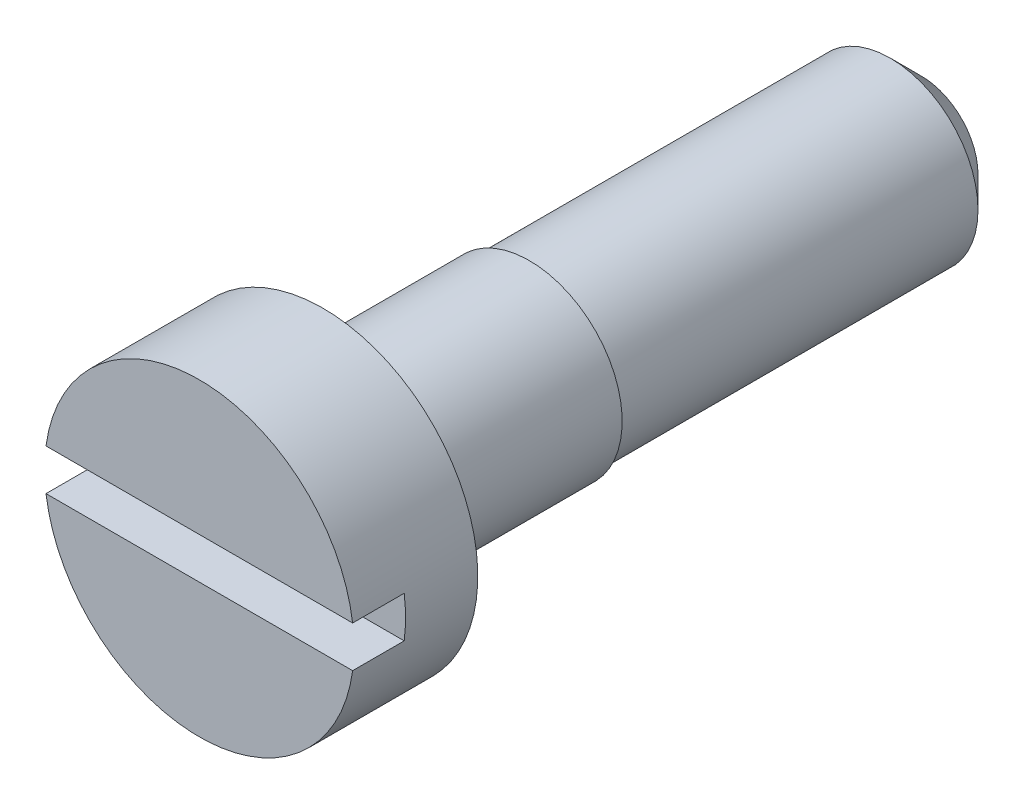
ISO-10303-21;
HEADER;
FILE_DESCRIPTION(('STEP AP214'),'2;1');
FILE_NAME('part.step','',(''),(''),'','','');
FILE_SCHEMA(('AUTOMOTIVE_DESIGN { 1 0 10303 214 1 1 1 1 }'));
ENDSEC;
DATA;
#1=APPLICATION_CONTEXT('core data for automotive mechanical design processes');
#2=APPLICATION_PROTOCOL_DEFINITION('international standard','automotive_design',2000,#1);
#3=PRODUCT_CONTEXT('',#1,'mechanical');
#4=PRODUCT('Part','Part','',(#3));
#5=PRODUCT_RELATED_PRODUCT_CATEGORY('part','',(#4));
#6=PRODUCT_DEFINITION_FORMATION('','',#4);
#7=PRODUCT_DEFINITION_CONTEXT('part definition',#1,'design');
#8=PRODUCT_DEFINITION('design','',#6,#7);
#9=PRODUCT_DEFINITION_SHAPE('','',#8);
#10=(LENGTH_UNIT() NAMED_UNIT(*) SI_UNIT(.MILLI.,.METRE.));
#11=(NAMED_UNIT(*) PLANE_ANGLE_UNIT() SI_UNIT($,.RADIAN.));
#12=(NAMED_UNIT(*) SI_UNIT($,.STERADIAN.) SOLID_ANGLE_UNIT());
#13=UNCERTAINTY_MEASURE_WITH_UNIT(LENGTH_MEASURE(1.E-05),#10,'distance_accuracy_value','');
#14=(GEOMETRIC_REPRESENTATION_CONTEXT(3) GLOBAL_UNCERTAINTY_ASSIGNED_CONTEXT((#13)) GLOBAL_UNIT_ASSIGNED_CONTEXT((#10,
#11,#12)) REPRESENTATION_CONTEXT('',''));
#15=CARTESIAN_POINT('',(0.,0.,0.));
#16=DIRECTION('',(0.,0.,1.));
#17=DIRECTION('',(1.,0.,0.));
#18=AXIS2_PLACEMENT_3D('',#15,#16,#17);
#19=CARTESIAN_POINT('',(0.,0.,-7.));
#20=DIRECTION('',(0.,0.,1.));
#21=DIRECTION('',(1.,0.,0.));
#22=AXIS2_PLACEMENT_3D('',#19,#20,#21);
#23=CYLINDRICAL_SURFACE('',#22,1.5);
#24=CARTESIAN_POINT('',(0.,0.,-1.2));
#25=DIRECTION('',(0.,0.,-1.));
#26=DIRECTION('',(-1.,0.,0.));
#27=AXIS2_PLACEMENT_3D('',#24,#25,#26);
#28=CIRCLE('',#27,1.5);
#29=CARTESIAN_POINT('',(-1.5,0.,-1.2));
#30=VERTEX_POINT('',#29);
#31=EDGE_CURVE('E112',#30,#30,#28,.F.);
#32=ORIENTED_EDGE('',*,*,#31,.T.);
#33=EDGE_LOOP('',(#32));
#34=FACE_BOUND('',#33,.T.);
#35=CARTESIAN_POINT('',(0.,0.,0.));
#36=DIRECTION('',(0.,0.,1.));
#37=DIRECTION('',(1.,0.,0.));
#38=AXIS2_PLACEMENT_3D('',#35,#36,#37);
#39=CIRCLE('',#38,1.5);
#40=CARTESIAN_POINT('',(1.48660687473185,0.2,0.));
#41=VERTEX_POINT('',#40);
#42=CARTESIAN_POINT('',(-1.48660687473185,0.2,0.));
#43=VERTEX_POINT('',#42);
#44=EDGE_CURVE('E103',#41,#43,#39,.T.);
#45=ORIENTED_EDGE('',*,*,#44,.F.);
#46=DIRECTION('',(0.,0.,1.));
#47=VECTOR('',#46,1.);
#48=CARTESIAN_POINT('',(1.48660687473185,0.2,-7.));
#49=LINE('',#48,#47);
#50=CARTESIAN_POINT('',(1.48660687473185,0.2,-0.5));
#51=VERTEX_POINT('',#50);
#52=EDGE_CURVE('E249',#41,#51,#49,.F.);
#53=ORIENTED_EDGE('',*,*,#52,.T.);
#54=CARTESIAN_POINT('',(0.,0.,-0.5));
#55=DIRECTION('',(0.,0.,-1.));
#56=DIRECTION('',(-1.,0.,0.));
#57=AXIS2_PLACEMENT_3D('',#54,#55,#56);
#58=CIRCLE('',#57,1.5);
#59=CARTESIAN_POINT('',(1.48660687473185,-0.2,-0.5));
#60=VERTEX_POINT('',#59);
#61=EDGE_CURVE('E77',#60,#51,#58,.F.);
#62=ORIENTED_EDGE('',*,*,#61,.F.);
#63=DIRECTION('',(0.,0.,1.));
#64=VECTOR('',#63,1.);
#65=CARTESIAN_POINT('',(1.48660687473185,-0.2,-7.));
#66=LINE('',#65,#64);
#67=CARTESIAN_POINT('',(1.48660687473185,-0.2,0.));
#68=VERTEX_POINT('',#67);
#69=EDGE_CURVE('E98',#68,#60,#66,.F.);
#70=ORIENTED_EDGE('',*,*,#69,.F.);
#71=CARTESIAN_POINT('',(-1.48660687473185,-0.2,0.));
#72=VERTEX_POINT('',#71);
#73=EDGE_CURVE('E107',#72,#68,#39,.T.);
#74=ORIENTED_EDGE('',*,*,#73,.F.);
#75=DIRECTION('',(0.,0.,1.));
#76=VECTOR('',#75,1.);
#77=CARTESIAN_POINT('',(-1.48660687473185,-0.2,-7.));
#78=LINE('',#77,#76);
#79=CARTESIAN_POINT('',(-1.48660687473185,-0.2,-0.5));
#80=VERTEX_POINT('',#79);
#81=EDGE_CURVE('E69',#80,#72,#78,.T.);
#82=ORIENTED_EDGE('',*,*,#81,.F.);
#83=CARTESIAN_POINT('',(-1.48660687473185,0.2,-0.5));
#84=VERTEX_POINT('',#83);
#85=EDGE_CURVE('E127',#84,#80,#58,.F.);
#86=ORIENTED_EDGE('',*,*,#85,.F.);
#87=DIRECTION('',(0.,0.,1.));
#88=VECTOR('',#87,1.);
#89=CARTESIAN_POINT('',(-1.48660687473185,0.2,-7.));
#90=LINE('',#89,#88);
#91=EDGE_CURVE('E109',#84,#43,#90,.T.);
#92=ORIENTED_EDGE('',*,*,#91,.T.);
#93=EDGE_LOOP('',(#45,#53,#62,#70,#74,#82,#86,#92));
#94=FACE_BOUND('',#93,.T.);
#95=ADVANCED_FACE('F54',(#34,#94),#23,.T.);
#96=CARTESIAN_POINT('',(0.,0.,0.));
#97=DIRECTION('',(0.,0.,1.));
#98=DIRECTION('',(1.,0.,0.));
#99=AXIS2_PLACEMENT_3D('',#96,#97,#98);
#100=PLANE('',#99);
#101=ORIENTED_EDGE('',*,*,#44,.T.);
#102=DIRECTION('',(1.,0.,0.));
#103=VECTOR('',#102,1.);
#104=CARTESIAN_POINT('',(0.,0.2,0.));
#105=LINE('',#104,#103);
#106=EDGE_CURVE('E102',#43,#41,#105,.T.);
#107=ORIENTED_EDGE('',*,*,#106,.T.);
#108=EDGE_LOOP('',(#101,#107));
#109=FACE_BOUND('',#108,.T.);
#110=ADVANCED_FACE('F142',(#109),#100,.T.);
#111=CARTESIAN_POINT('',(0.,0.,-1.2));
#112=DIRECTION('',(0.,0.,-1.));
#113=DIRECTION('',(-1.,0.,0.));
#114=AXIS2_PLACEMENT_3D('',#111,#112,#113);
#115=CYLINDRICAL_SURFACE('',#114,0.9);
#116=CARTESIAN_POINT('',(0.,0.,-1.2));
#117=DIRECTION('',(0.,0.,-1.));
#118=DIRECTION('',(-1.,0.,0.));
#119=AXIS2_PLACEMENT_3D('',#116,#117,#118);
#120=CIRCLE('',#119,0.9);
#121=CARTESIAN_POINT('',(-0.9,0.,-1.2));
#122=VERTEX_POINT('',#121);
#123=EDGE_CURVE('E116',#122,#122,#120,.T.);
#124=ORIENTED_EDGE('',*,*,#123,.T.);
#125=EDGE_LOOP('',(#124));
#126=FACE_BOUND('',#125,.T.);
#127=CARTESIAN_POINT('',(0.,0.,-3.2));
#128=DIRECTION('',(0.,0.,-1.));
#129=DIRECTION('',(-1.,0.,0.));
#130=AXIS2_PLACEMENT_3D('',#127,#128,#129);
#131=CIRCLE('',#130,0.9);
#132=CARTESIAN_POINT('',(-0.9,0.,-3.2));
#133=VERTEX_POINT('',#132);
#134=EDGE_CURVE('E121',#133,#133,#131,.F.);
#135=ORIENTED_EDGE('',*,*,#134,.T.);
#136=EDGE_LOOP('',(#135));
#137=FACE_BOUND('',#136,.T.);
#138=ADVANCED_FACE('F147',(#126,#137),#115,.T.);
#139=DIRECTION('',(1.,0.,0.));
#140=VECTOR('',#139,1.);
#141=CARTESIAN_POINT('',(0.,-0.2,0.));
#142=LINE('',#141,#140);
#143=EDGE_CURVE('E95',#72,#68,#142,.T.);
#144=ORIENTED_EDGE('',*,*,#143,.F.);
#145=ORIENTED_EDGE('',*,*,#73,.T.);
#146=EDGE_LOOP('',(#144,#145));
#147=FACE_BOUND('',#146,.T.);
#148=ADVANCED_FACE('F111',(#147),#100,.T.);
#149=CARTESIAN_POINT('',(0.,0.,-1.2));
#150=DIRECTION('',(0.,0.,-1.));
#151=DIRECTION('',(-1.,0.,0.));
#152=AXIS2_PLACEMENT_3D('',#149,#150,#151);
#153=PLANE('',#152);
#154=ORIENTED_EDGE('',*,*,#31,.F.);
#155=EDGE_LOOP('',(#154));
#156=FACE_BOUND('',#155,.T.);
#157=ORIENTED_EDGE('',*,*,#123,.F.);
#158=EDGE_LOOP('',(#157));
#159=FACE_BOUND('',#158,.T.);
#160=ADVANCED_FACE('F152',(#156,#159),#153,.T.);
#161=CARTESIAN_POINT('',(0.,0.,-3.2));
#162=DIRECTION('',(0.,0.,-1.));
#163=DIRECTION('',(-1.,0.,0.));
#164=AXIS2_PLACEMENT_3D('',#161,#162,#163);
#165=PLANE('',#164);
#166=ORIENTED_EDGE('',*,*,#134,.F.);
#167=EDGE_LOOP('',(#166));
#168=FACE_BOUND('',#167,.T.);
#169=CARTESIAN_POINT('',(0.,0.,-3.2));
#170=DIRECTION('',(0.,0.,-1.));
#171=DIRECTION('',(-1.,0.,0.));
#172=AXIS2_PLACEMENT_3D('',#169,#170,#171);
#173=CIRCLE('',#172,0.85);
#174=CARTESIAN_POINT('',(-0.85,0.,-3.2));
#175=VERTEX_POINT('',#174);
#176=EDGE_CURVE('E123',#175,#175,#173,.T.);
#177=ORIENTED_EDGE('',*,*,#176,.F.);
#178=EDGE_LOOP('',(#177));
#179=FACE_BOUND('',#178,.T.);
#180=ADVANCED_FACE('F159',(#168,#179),#165,.T.);
#181=CARTESIAN_POINT('',(0.,0.,-3.2));
#182=DIRECTION('',(0.,0.,-1.));
#183=DIRECTION('',(-1.,0.,0.));
#184=AXIS2_PLACEMENT_3D('',#181,#182,#183);
#185=CYLINDRICAL_SURFACE('',#184,0.85);
#186=CARTESIAN_POINT('',(0.,0.,-6.7));
#187=DIRECTION('',(0.,0.,1.));
#188=DIRECTION('',(1.,0.,0.));
#189=AXIS2_PLACEMENT_3D('',#186,#187,#188);
#190=CIRCLE('',#189,0.85);
#191=CARTESIAN_POINT('',(0.85,0.,-6.7));
#192=VERTEX_POINT('',#191);
#193=EDGE_CURVE('E14',#192,#192,#190,.T.);
#194=ORIENTED_EDGE('',*,*,#193,.T.);
#195=EDGE_LOOP('',(#194));
#196=FACE_BOUND('',#195,.T.);
#197=ORIENTED_EDGE('',*,*,#176,.T.);
#198=EDGE_LOOP('',(#197));
#199=FACE_BOUND('',#198,.T.);
#200=ADVANCED_FACE('F156',(#196,#199),#185,.T.);
#201=CARTESIAN_POINT('',(0.,0.,-7.));
#202=DIRECTION('',(0.,0.,1.));
#203=DIRECTION('',(1.,0.,0.));
#204=AXIS2_PLACEMENT_3D('',#201,#202,#203);
#205=PLANE('',#204);
#206=CARTESIAN_POINT('',(0.,0.,-7.));
#207=DIRECTION('',(0.,0.,1.));
#208=DIRECTION('',(1.,0.,0.));
#209=AXIS2_PLACEMENT_3D('',#206,#207,#208);
#210=CIRCLE('',#209,0.550000000000003);
#211=CARTESIAN_POINT('',(0.550000000000003,0.,-7.));
#212=VERTEX_POINT('',#211);
#213=EDGE_CURVE('E62',#212,#212,#210,.F.);
#214=ORIENTED_EDGE('',*,*,#213,.T.);
#215=EDGE_LOOP('',(#214));
#216=FACE_BOUND('',#215,.T.);
#217=ADVANCED_FACE('F131',(#216),#205,.F.);
#218=CARTESIAN_POINT('',(-1.6,0.2,-0.5));
#219=DIRECTION('',(0.,-1.,0.));
#220=DIRECTION('',(0.,0.,-1.));
#221=AXIS2_PLACEMENT_3D('',#218,#219,#220);
#222=PLANE('',#221);
#223=ORIENTED_EDGE('',*,*,#106,.F.);
#224=ORIENTED_EDGE('',*,*,#91,.F.);
#225=DIRECTION('',(1.,0.,0.));
#226=VECTOR('',#225,1.);
#227=CARTESIAN_POINT('',(-1.6,0.2,-0.5));
#228=LINE('',#227,#226);
#229=EDGE_CURVE('E261',#84,#51,#228,.T.);
#230=ORIENTED_EDGE('',*,*,#229,.T.);
#231=ORIENTED_EDGE('',*,*,#52,.F.);
#232=EDGE_LOOP('',(#223,#224,#230,#231));
#233=FACE_BOUND('',#232,.T.);
#234=ADVANCED_FACE('F155',(#233),#222,.T.);
#235=CARTESIAN_POINT('',(-1.6,-0.2,-0.5));
#236=DIRECTION('',(0.,-1.,0.));
#237=DIRECTION('',(0.,0.,-1.));
#238=AXIS2_PLACEMENT_3D('',#235,#236,#237);
#239=PLANE('',#238);
#240=ORIENTED_EDGE('',*,*,#69,.T.);
#241=DIRECTION('',(1.,0.,0.));
#242=VECTOR('',#241,1.);
#243=CARTESIAN_POINT('',(-1.6,-0.2,-0.5));
#244=LINE('',#243,#242);
#245=EDGE_CURVE('E259',#80,#60,#244,.T.);
#246=ORIENTED_EDGE('',*,*,#245,.F.);
#247=ORIENTED_EDGE('',*,*,#81,.T.);
#248=ORIENTED_EDGE('',*,*,#143,.T.);
#249=EDGE_LOOP('',(#240,#246,#247,#248));
#250=FACE_BOUND('',#249,.T.);
#251=ADVANCED_FACE('F97',(#250),#239,.F.);
#252=CARTESIAN_POINT('',(0.,0.,-0.5));
#253=DIRECTION('',(0.,0.,-1.));
#254=DIRECTION('',(-1.,0.,0.));
#255=AXIS2_PLACEMENT_3D('',#252,#253,#254);
#256=PLANE('',#255);
#257=ORIENTED_EDGE('',*,*,#61,.T.);
#258=ORIENTED_EDGE('',*,*,#229,.F.);
#259=ORIENTED_EDGE('',*,*,#85,.T.);
#260=ORIENTED_EDGE('',*,*,#245,.T.);
#261=EDGE_LOOP('',(#257,#258,#259,#260));
#262=FACE_BOUND('',#261,.T.);
#263=ADVANCED_FACE('F134',(#262),#256,.F.);
#264=CARTESIAN_POINT('',(0.,0.,-7.));
#265=DIRECTION('',(0.,0.,1.));
#266=DIRECTION('',(1.,0.,0.));
#267=AXIS2_PLACEMENT_3D('',#264,#265,#266);
#268=CONICAL_SURFACE('',#267,0.550000000000003,0.785398163397448);
#269=ORIENTED_EDGE('',*,*,#193,.F.);
#270=EDGE_LOOP('',(#269));
#271=FACE_BOUND('',#270,.T.);
#272=ORIENTED_EDGE('',*,*,#213,.F.);
#273=EDGE_LOOP('',(#272));
#274=FACE_BOUND('',#273,.T.);
#275=ADVANCED_FACE('F56',(#271,#274),#268,.T.);
#276=CLOSED_SHELL('',(#95,#110,#138,#148,#160,#180,#200,#217,#234,#251,#263,#275));
#277=MANIFOLD_SOLID_BREP('B2',#276);
#278=ADVANCED_BREP_SHAPE_REPRESENTATION('',(#18,#277),#14);
#279=SHAPE_DEFINITION_REPRESENTATION(#9,#278);
ENDSEC;
END-ISO-10303-21;
